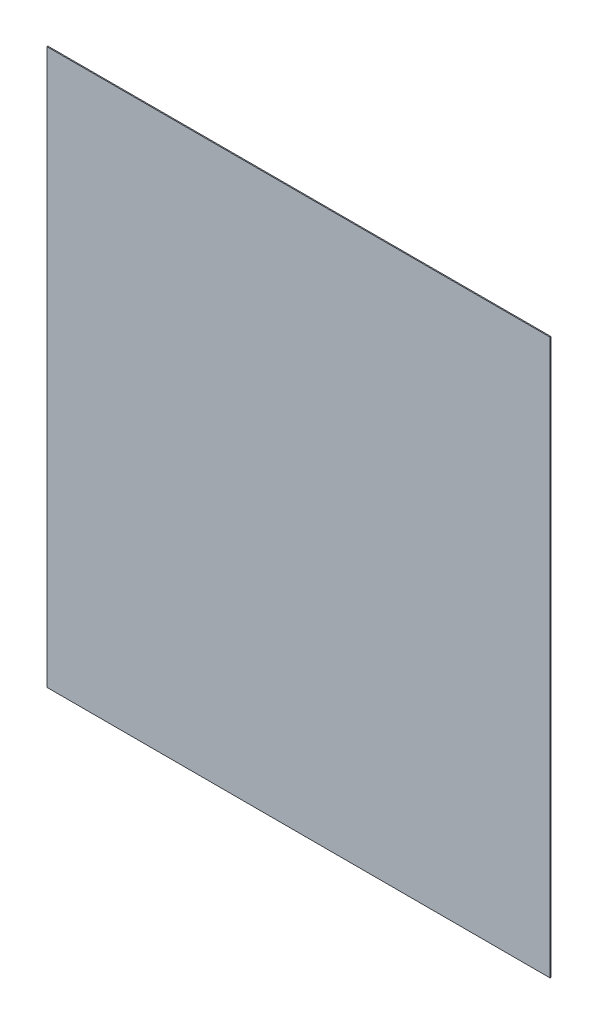
ISO-10303-21;
HEADER;
FILE_DESCRIPTION(('STEP AP214'),'2;1');
FILE_NAME('part.step','',(''),(''),'','','');
FILE_SCHEMA(('AUTOMOTIVE_DESIGN { 1 0 10303 214 1 1 1 1 }'));
ENDSEC;
DATA;
#1=APPLICATION_CONTEXT('core data for automotive mechanical design processes');
#2=APPLICATION_PROTOCOL_DEFINITION('international standard','automotive_design',2000,#1);
#3=PRODUCT_CONTEXT('',#1,'mechanical');
#4=PRODUCT('Part','Part','',(#3));
#5=PRODUCT_RELATED_PRODUCT_CATEGORY('part','',(#4));
#6=PRODUCT_DEFINITION_FORMATION('','',#4);
#7=PRODUCT_DEFINITION_CONTEXT('part definition',#1,'design');
#8=PRODUCT_DEFINITION('design','',#6,#7);
#9=PRODUCT_DEFINITION_SHAPE('','',#8);
#10=(LENGTH_UNIT() NAMED_UNIT(*) SI_UNIT(.MILLI.,.METRE.));
#11=(NAMED_UNIT(*) PLANE_ANGLE_UNIT() SI_UNIT($,.RADIAN.));
#12=(NAMED_UNIT(*) SI_UNIT($,.STERADIAN.) SOLID_ANGLE_UNIT());
#13=UNCERTAINTY_MEASURE_WITH_UNIT(LENGTH_MEASURE(1.E-05),#10,'distance_accuracy_value','');
#14=(GEOMETRIC_REPRESENTATION_CONTEXT(3) GLOBAL_UNCERTAINTY_ASSIGNED_CONTEXT((#13)) GLOBAL_UNIT_ASSIGNED_CONTEXT((#10,
#11,#12)) REPRESENTATION_CONTEXT('',''));
#15=CARTESIAN_POINT('',(0.,0.,0.));
#16=DIRECTION('',(0.,0.,1.));
#17=DIRECTION('',(1.,0.,0.));
#18=AXIS2_PLACEMENT_3D('',#15,#16,#17);
#19=CARTESIAN_POINT('',(9.664392013097E-06,2.158834554393E-05,0.00100076));
#20=DIRECTION('',(0.,0.,1.));
#21=DIRECTION('',(1.,0.,0.));
#22=AXIS2_PLACEMENT_3D('',#19,#20,#21);
#23=PLANE('',#22);
#24=DIRECTION('',(0.,-1.,0.));
#25=VECTOR('',#24,1.);
#26=CARTESIAN_POINT('',(-0.24957024,0.27518868,0.00100076));
#27=LINE('',#26,#25);
#28=CARTESIAN_POINT('',(-0.24957024,0.27518868,0.00100076));
#29=VERTEX_POINT('',#28);
#30=CARTESIAN_POINT('',(-0.24957024,-0.27510486,0.00100076));
#31=VERTEX_POINT('',#30);
#32=EDGE_CURVE('E95',#29,#31,#27,.T.);
#33=ORIENTED_EDGE('',*,*,#32,.T.);
#34=DIRECTION('',(0.999999986741579,-0.000162839926198131,0.));
#35=VECTOR('',#34,1.);
#36=CARTESIAN_POINT('',(-0.24957024,-0.27510486,0.00100076));
#37=LINE('',#36,#35);
#38=CARTESIAN_POINT('',(0.24957024,-0.27518614,0.00100076));
#39=VERTEX_POINT('',#38);
#40=EDGE_CURVE('E76',#31,#39,#37,.T.);
#41=ORIENTED_EDGE('',*,*,#40,.T.);
#42=DIRECTION('',(0.,1.,0.));
#43=VECTOR('',#42,1.);
#44=CARTESIAN_POINT('',(0.24957024,-0.27518614,0.00100076));
#45=LINE('',#44,#43);
#46=CARTESIAN_POINT('',(0.24957024,0.27518868,0.00100076));
#47=VERTEX_POINT('',#46);
#48=EDGE_CURVE('E80',#39,#47,#45,.T.);
#49=ORIENTED_EDGE('',*,*,#48,.T.);
#50=DIRECTION('',(-1.,0.,0.));
#51=VECTOR('',#50,1.);
#52=CARTESIAN_POINT('',(0.24957024,0.27518868,0.00100076));
#53=LINE('',#52,#51);
#54=EDGE_CURVE('E11',#47,#29,#53,.T.);
#55=ORIENTED_EDGE('',*,*,#54,.T.);
#56=EDGE_LOOP('',(#33,#41,#49,#55));
#57=FACE_BOUND('',#56,.T.);
#58=ADVANCED_FACE('F17',(#57),#23,.T.);
#59=CARTESIAN_POINT('',(9.664392013097E-06,2.158834554393E-05,0.));
#60=DIRECTION('',(0.,0.,1.));
#61=DIRECTION('',(1.,0.,0.));
#62=AXIS2_PLACEMENT_3D('',#59,#60,#61);
#63=PLANE('',#62);
#64=DIRECTION('',(-1.,0.,0.));
#65=VECTOR('',#64,1.);
#66=CARTESIAN_POINT('',(0.24957024,0.27518868,0.));
#67=LINE('',#66,#65);
#68=CARTESIAN_POINT('',(0.24957024,0.27518868,0.));
#69=VERTEX_POINT('',#68);
#70=CARTESIAN_POINT('',(-0.24957024,0.27518868,0.));
#71=VERTEX_POINT('',#70);
#72=EDGE_CURVE('E25',#69,#71,#67,.T.);
#73=ORIENTED_EDGE('',*,*,#72,.F.);
#74=DIRECTION('',(0.,1.,0.));
#75=VECTOR('',#74,1.);
#76=CARTESIAN_POINT('',(0.24957024,-0.27518614,0.));
#77=LINE('',#76,#75);
#78=CARTESIAN_POINT('',(0.24957024,-0.27518614,0.));
#79=VERTEX_POINT('',#78);
#80=EDGE_CURVE('E66',#79,#69,#77,.T.);
#81=ORIENTED_EDGE('',*,*,#80,.F.);
#82=DIRECTION('',(0.999999986741579,-0.000162839926198131,0.));
#83=VECTOR('',#82,1.);
#84=CARTESIAN_POINT('',(-0.24957024,-0.27510486,0.));
#85=LINE('',#84,#83);
#86=CARTESIAN_POINT('',(-0.24957024,-0.27510486,0.));
#87=VERTEX_POINT('',#86);
#88=EDGE_CURVE('E70',#87,#79,#85,.T.);
#89=ORIENTED_EDGE('',*,*,#88,.F.);
#90=DIRECTION('',(0.,-1.,0.));
#91=VECTOR('',#90,1.);
#92=CARTESIAN_POINT('',(-0.24957024,0.27518868,0.));
#93=LINE('',#92,#91);
#94=EDGE_CURVE('E98',#71,#87,#93,.T.);
#95=ORIENTED_EDGE('',*,*,#94,.F.);
#96=EDGE_LOOP('',(#73,#81,#89,#95));
#97=FACE_BOUND('',#96,.T.);
#98=ADVANCED_FACE('F68',(#97),#63,.F.);
#99=CARTESIAN_POINT('',(0.24957024,0.27518868,0.));
#100=DIRECTION('',(0.,-1.,0.));
#101=DIRECTION('',(0.,0.,-1.));
#102=AXIS2_PLACEMENT_3D('',#99,#100,#101);
#103=PLANE('',#102);
#104=ORIENTED_EDGE('',*,*,#72,.T.);
#105=DIRECTION('',(0.,0.,1.));
#106=VECTOR('',#105,1.);
#107=CARTESIAN_POINT('',(-0.24957024,0.27518868,0.));
#108=LINE('',#107,#106);
#109=EDGE_CURVE('E90',#71,#29,#108,.T.);
#110=ORIENTED_EDGE('',*,*,#109,.T.);
#111=ORIENTED_EDGE('',*,*,#54,.F.);
#112=DIRECTION('',(0.,0.,1.));
#113=VECTOR('',#112,1.);
#114=CARTESIAN_POINT('',(0.24957024,0.27518868,0.));
#115=LINE('',#114,#113);
#116=EDGE_CURVE('E75',#69,#47,#115,.T.);
#117=ORIENTED_EDGE('',*,*,#116,.F.);
#118=EDGE_LOOP('',(#104,#110,#111,#117));
#119=FACE_BOUND('',#118,.T.);
#120=ADVANCED_FACE('F120',(#119),#103,.F.);
#121=CARTESIAN_POINT('',(0.24957024,-0.27518614,0.));
#122=DIRECTION('',(-1.,0.,0.));
#123=DIRECTION('',(0.,0.,1.));
#124=AXIS2_PLACEMENT_3D('',#121,#122,#123);
#125=PLANE('',#124);
#126=ORIENTED_EDGE('',*,*,#80,.T.);
#127=ORIENTED_EDGE('',*,*,#116,.T.);
#128=ORIENTED_EDGE('',*,*,#48,.F.);
#129=DIRECTION('',(0.,0.,1.));
#130=VECTOR('',#129,1.);
#131=CARTESIAN_POINT('',(0.24957024,-0.27518614,0.));
#132=LINE('',#131,#130);
#133=EDGE_CURVE('E78',#79,#39,#132,.T.);
#134=ORIENTED_EDGE('',*,*,#133,.F.);
#135=EDGE_LOOP('',(#126,#127,#128,#134));
#136=FACE_BOUND('',#135,.T.);
#137=ADVANCED_FACE('F79',(#136),#125,.F.);
#138=CARTESIAN_POINT('',(-0.24957024,-0.27510486,0.));
#139=DIRECTION('',(0.000162839926198131,0.999999986741579,0.));
#140=DIRECTION('',(0.,0.,-1.));
#141=AXIS2_PLACEMENT_3D('',#138,#139,#140);
#142=PLANE('',#141);
#143=ORIENTED_EDGE('',*,*,#88,.T.);
#144=ORIENTED_EDGE('',*,*,#133,.T.);
#145=ORIENTED_EDGE('',*,*,#40,.F.);
#146=DIRECTION('',(0.,0.,1.));
#147=VECTOR('',#146,1.);
#148=CARTESIAN_POINT('',(-0.24957024,-0.27510486,0.));
#149=LINE('',#148,#147);
#150=EDGE_CURVE('E87',#87,#31,#149,.T.);
#151=ORIENTED_EDGE('',*,*,#150,.F.);
#152=EDGE_LOOP('',(#143,#144,#145,#151));
#153=FACE_BOUND('',#152,.T.);
#154=ADVANCED_FACE('F85',(#153),#142,.F.);
#155=CARTESIAN_POINT('',(-0.24957024,0.27518868,0.));
#156=DIRECTION('',(1.,0.,0.));
#157=DIRECTION('',(0.,1.,0.));
#158=AXIS2_PLACEMENT_3D('',#155,#156,#157);
#159=PLANE('',#158);
#160=ORIENTED_EDGE('',*,*,#94,.T.);
#161=ORIENTED_EDGE('',*,*,#150,.T.);
#162=ORIENTED_EDGE('',*,*,#32,.F.);
#163=ORIENTED_EDGE('',*,*,#109,.F.);
#164=EDGE_LOOP('',(#160,#161,#162,#163));
#165=FACE_BOUND('',#164,.T.);
#166=ADVANCED_FACE('F117',(#165),#159,.F.);
#167=CLOSED_SHELL('',(#58,#98,#120,#137,#154,#166));
#168=MANIFOLD_SOLID_BREP('B1',#167);
#169=ADVANCED_BREP_SHAPE_REPRESENTATION('',(#18,#168),#14);
#170=SHAPE_DEFINITION_REPRESENTATION(#9,#169);
ENDSEC;
END-ISO-10303-21;
